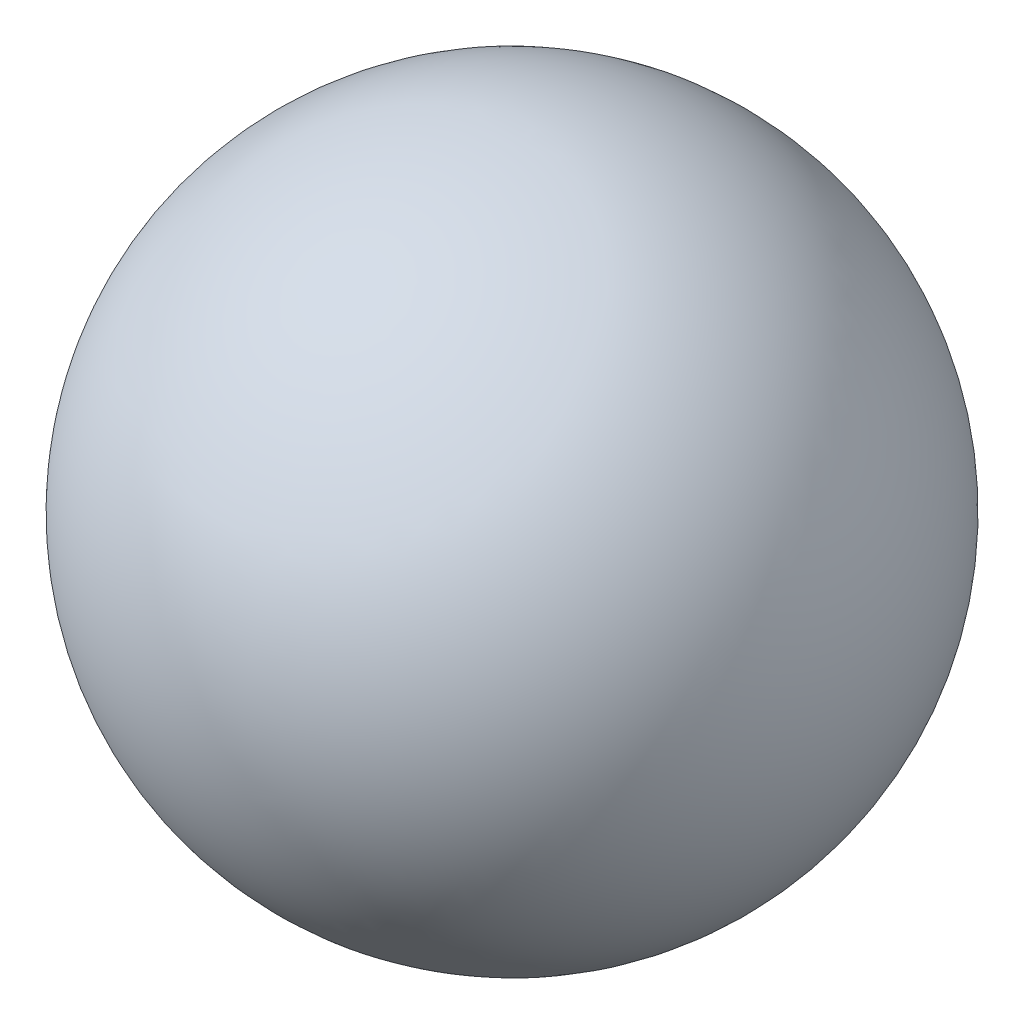
ISO-10303-21;
HEADER;
FILE_DESCRIPTION(('STEP AP214'),'2;1');
FILE_NAME('part.step','',(''),(''),'','','');
FILE_SCHEMA(('AUTOMOTIVE_DESIGN { 1 0 10303 214 1 1 1 1 }'));
ENDSEC;
DATA;
#1=APPLICATION_CONTEXT('core data for automotive mechanical design processes');
#2=APPLICATION_PROTOCOL_DEFINITION('international standard','automotive_design',2000,#1);
#3=PRODUCT_CONTEXT('',#1,'mechanical');
#4=PRODUCT('Part','Part','',(#3));
#5=PRODUCT_RELATED_PRODUCT_CATEGORY('part','',(#4));
#6=PRODUCT_DEFINITION_FORMATION('','',#4);
#7=PRODUCT_DEFINITION_CONTEXT('part definition',#1,'design');
#8=PRODUCT_DEFINITION('design','',#6,#7);
#9=PRODUCT_DEFINITION_SHAPE('','',#8);
#10=(LENGTH_UNIT() NAMED_UNIT(*) SI_UNIT(.MILLI.,.METRE.));
#11=(NAMED_UNIT(*) PLANE_ANGLE_UNIT() SI_UNIT($,.RADIAN.));
#12=(NAMED_UNIT(*) SI_UNIT($,.STERADIAN.) SOLID_ANGLE_UNIT());
#13=UNCERTAINTY_MEASURE_WITH_UNIT(LENGTH_MEASURE(1.E-05),#10,'distance_accuracy_value','');
#14=(GEOMETRIC_REPRESENTATION_CONTEXT(3) GLOBAL_UNCERTAINTY_ASSIGNED_CONTEXT((#13)) GLOBAL_UNIT_ASSIGNED_CONTEXT((#10,
#11,#12)) REPRESENTATION_CONTEXT('',''));
#15=CARTESIAN_POINT('',(0.,0.,0.));
#16=DIRECTION('',(0.,0.,1.));
#17=DIRECTION('',(1.,0.,0.));
#18=AXIS2_PLACEMENT_3D('',#15,#16,#17);
#19=CARTESIAN_POINT('',(64.16,68.0523917870283,-13.5230418569492));
#20=DIRECTION('',(0.,0.980822273280607,-0.194904254024027));
#21=DIRECTION('',(0.173648177666933,0.191943220457923,0.9659213790538));
#22=AXIS2_PLACEMENT_3D('',#19,#20,#21);
#23=SPHERICAL_SURFACE('',#22,7.15);
#24=CARTESIAN_POINT('',(64.16,61.0395125330719,-12.1294764406774));
#25=VERTEX_POINT('',#24);
#26=VERTEX_LOOP('',#25);
#27=FACE_BOUND('',#26,.T.);
#28=CARTESIAN_POINT('',(64.16,75.0652710409846,-14.916607273221));
#29=VERTEX_POINT('',#28);
#30=VERTEX_LOOP('',#29);
#31=FACE_BOUND('',#30,.T.);
#32=ADVANCED_FACE('F16',(#27,#31),#23,.T.);
#33=CLOSED_SHELL('',(#32));
#34=MANIFOLD_SOLID_BREP('B1',#33);
#35=ADVANCED_BREP_SHAPE_REPRESENTATION('',(#18,#34),#14);
#36=SHAPE_DEFINITION_REPRESENTATION(#9,#35);
ENDSEC;
END-ISO-10303-21;
